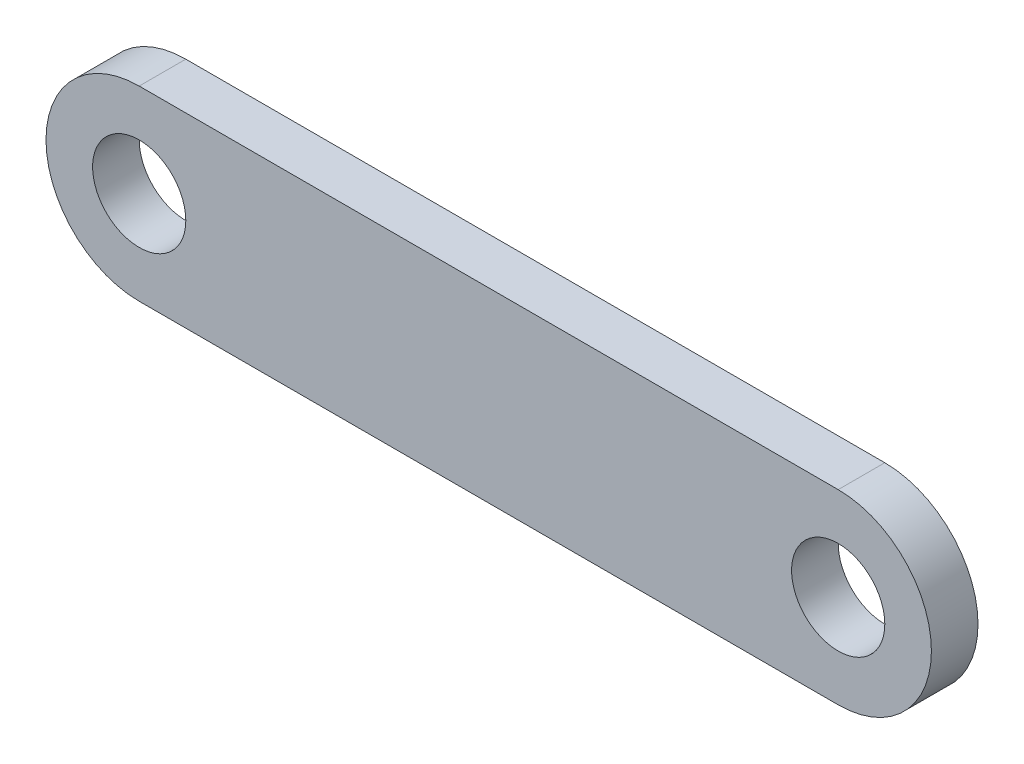
ISO-10303-21;
HEADER;
FILE_DESCRIPTION(('STEP AP214'),'2;1');
FILE_NAME('part.step','',(''),(''),'','','');
FILE_SCHEMA(('AUTOMOTIVE_DESIGN { 1 0 10303 214 1 1 1 1 }'));
ENDSEC;
DATA;
#1=APPLICATION_CONTEXT('core data for automotive mechanical design processes');
#2=APPLICATION_PROTOCOL_DEFINITION('international standard','automotive_design',2000,#1);
#3=PRODUCT_CONTEXT('',#1,'mechanical');
#4=PRODUCT('Part','Part','',(#3));
#5=PRODUCT_RELATED_PRODUCT_CATEGORY('part','',(#4));
#6=PRODUCT_DEFINITION_FORMATION('','',#4);
#7=PRODUCT_DEFINITION_CONTEXT('part definition',#1,'design');
#8=PRODUCT_DEFINITION('design','',#6,#7);
#9=PRODUCT_DEFINITION_SHAPE('','',#8);
#10=(LENGTH_UNIT() NAMED_UNIT(*) SI_UNIT(.MILLI.,.METRE.));
#11=(NAMED_UNIT(*) PLANE_ANGLE_UNIT() SI_UNIT($,.RADIAN.));
#12=(NAMED_UNIT(*) SI_UNIT($,.STERADIAN.) SOLID_ANGLE_UNIT());
#13=UNCERTAINTY_MEASURE_WITH_UNIT(LENGTH_MEASURE(1.E-05),#10,'distance_accuracy_value','');
#14=(GEOMETRIC_REPRESENTATION_CONTEXT(3) GLOBAL_UNCERTAINTY_ASSIGNED_CONTEXT((#13)) GLOBAL_UNIT_ASSIGNED_CONTEXT((#10,
#11,#12)) REPRESENTATION_CONTEXT('',''));
#15=CARTESIAN_POINT('',(0.,0.,0.));
#16=DIRECTION('',(0.,0.,1.));
#17=DIRECTION('',(1.,0.,0.));
#18=AXIS2_PLACEMENT_3D('',#15,#16,#17);
#19=CARTESIAN_POINT('',(0.,0.,2.54));
#20=DIRECTION('',(0.,0.,1.));
#21=DIRECTION('',(1.,0.,0.));
#22=AXIS2_PLACEMENT_3D('',#19,#20,#21);
#23=PLANE('',#22);
#24=CARTESIAN_POINT('',(0.,0.,2.54));
#25=DIRECTION('',(0.,0.,1.));
#26=DIRECTION('',(1.,0.,0.));
#27=AXIS2_PLACEMENT_3D('',#24,#25,#26);
#28=CIRCLE('',#27,2.54);
#29=CARTESIAN_POINT('',(2.54,0.,2.54));
#30=VERTEX_POINT('',#29);
#31=EDGE_CURVE('E101',#30,#30,#28,.T.);
#32=ORIENTED_EDGE('',*,*,#31,.F.);
#33=EDGE_LOOP('',(#32));
#34=FACE_BOUND('',#33,.T.);
#35=CARTESIAN_POINT('',(0.,0.,2.54));
#36=DIRECTION('',(0.,0.,1.));
#37=DIRECTION('',(1.,0.,0.));
#38=AXIS2_PLACEMENT_3D('',#35,#36,#37);
#39=CIRCLE('',#38,5.08);
#40=CARTESIAN_POINT('',(0.,5.08,2.54));
#41=VERTEX_POINT('',#40);
#42=CARTESIAN_POINT('',(0.,-5.08,2.54));
#43=VERTEX_POINT('',#42);
#44=EDGE_CURVE('E86',#41,#43,#39,.T.);
#45=ORIENTED_EDGE('',*,*,#44,.T.);
#46=DIRECTION('',(1.,0.,0.));
#47=VECTOR('',#46,1.);
#48=CARTESIAN_POINT('',(0.,-5.08,2.54));
#49=LINE('',#48,#47);
#50=CARTESIAN_POINT('',(38.1,-5.08,2.54));
#51=VERTEX_POINT('',#50);
#52=EDGE_CURVE('E81',#43,#51,#49,.T.);
#53=ORIENTED_EDGE('',*,*,#52,.T.);
#54=CARTESIAN_POINT('',(38.1,0.,2.54));
#55=DIRECTION('',(0.,0.,1.));
#56=DIRECTION('',(1.,0.,0.));
#57=AXIS2_PLACEMENT_3D('',#54,#55,#56);
#58=CIRCLE('',#57,5.08);
#59=CARTESIAN_POINT('',(38.1,5.08,2.54));
#60=VERTEX_POINT('',#59);
#61=EDGE_CURVE('E84',#51,#60,#58,.T.);
#62=ORIENTED_EDGE('',*,*,#61,.T.);
#63=DIRECTION('',(-1.,0.,0.));
#64=VECTOR('',#63,1.);
#65=CARTESIAN_POINT('',(0.,5.08,2.54));
#66=LINE('',#65,#64);
#67=EDGE_CURVE('E51',#60,#41,#66,.T.);
#68=ORIENTED_EDGE('',*,*,#67,.T.);
#69=EDGE_LOOP('',(#45,#53,#62,#68));
#70=FACE_BOUND('',#69,.T.);
#71=CARTESIAN_POINT('',(38.1,0.,2.54));
#72=DIRECTION('',(0.,0.,1.));
#73=DIRECTION('',(1.,0.,0.));
#74=AXIS2_PLACEMENT_3D('',#71,#72,#73);
#75=CIRCLE('',#74,2.54);
#76=CARTESIAN_POINT('',(40.64,0.,2.54));
#77=VERTEX_POINT('',#76);
#78=EDGE_CURVE('E116',#77,#77,#75,.T.);
#79=ORIENTED_EDGE('',*,*,#78,.F.);
#80=EDGE_LOOP('',(#79));
#81=FACE_BOUND('',#80,.T.);
#82=ADVANCED_FACE('F34',(#34,#70,#81),#23,.T.);
#83=CARTESIAN_POINT('',(0.,0.,0.));
#84=DIRECTION('',(0.,0.,1.));
#85=DIRECTION('',(1.,0.,0.));
#86=AXIS2_PLACEMENT_3D('',#83,#84,#85);
#87=PLANE('',#86);
#88=CARTESIAN_POINT('',(0.,0.,0.));
#89=DIRECTION('',(0.,0.,1.));
#90=DIRECTION('',(1.,0.,0.));
#91=AXIS2_PLACEMENT_3D('',#88,#89,#90);
#92=CIRCLE('',#91,5.08);
#93=CARTESIAN_POINT('',(0.,5.08,0.));
#94=VERTEX_POINT('',#93);
#95=CARTESIAN_POINT('',(0.,-5.08,0.));
#96=VERTEX_POINT('',#95);
#97=EDGE_CURVE('E98',#94,#96,#92,.T.);
#98=ORIENTED_EDGE('',*,*,#97,.F.);
#99=DIRECTION('',(-1.,0.,0.));
#100=VECTOR('',#99,1.);
#101=CARTESIAN_POINT('',(0.,5.08,0.));
#102=LINE('',#101,#100);
#103=CARTESIAN_POINT('',(38.1,5.08,0.));
#104=VERTEX_POINT('',#103);
#105=EDGE_CURVE('E74',#104,#94,#102,.T.);
#106=ORIENTED_EDGE('',*,*,#105,.F.);
#107=CARTESIAN_POINT('',(38.1,0.,0.));
#108=DIRECTION('',(0.,0.,1.));
#109=DIRECTION('',(1.,0.,0.));
#110=AXIS2_PLACEMENT_3D('',#107,#108,#109);
#111=CIRCLE('',#110,5.08);
#112=CARTESIAN_POINT('',(38.1,-5.08,0.));
#113=VERTEX_POINT('',#112);
#114=EDGE_CURVE('E68',#113,#104,#111,.T.);
#115=ORIENTED_EDGE('',*,*,#114,.F.);
#116=DIRECTION('',(1.,0.,0.));
#117=VECTOR('',#116,1.);
#118=CARTESIAN_POINT('',(0.,-5.08,0.));
#119=LINE('',#118,#117);
#120=EDGE_CURVE('E90',#96,#113,#119,.T.);
#121=ORIENTED_EDGE('',*,*,#120,.F.);
#122=EDGE_LOOP('',(#98,#106,#115,#121));
#123=FACE_BOUND('',#122,.T.);
#124=CARTESIAN_POINT('',(0.,0.,0.));
#125=DIRECTION('',(0.,0.,1.));
#126=DIRECTION('',(1.,0.,0.));
#127=AXIS2_PLACEMENT_3D('',#124,#125,#126);
#128=CIRCLE('',#127,2.54);
#129=CARTESIAN_POINT('',(2.54,0.,0.));
#130=VERTEX_POINT('',#129);
#131=EDGE_CURVE('E113',#130,#130,#128,.T.);
#132=ORIENTED_EDGE('',*,*,#131,.T.);
#133=EDGE_LOOP('',(#132));
#134=FACE_BOUND('',#133,.T.);
#135=CARTESIAN_POINT('',(38.1,0.,0.));
#136=DIRECTION('',(0.,0.,1.));
#137=DIRECTION('',(1.,0.,0.));
#138=AXIS2_PLACEMENT_3D('',#135,#136,#137);
#139=CIRCLE('',#138,2.54);
#140=CARTESIAN_POINT('',(40.64,0.,0.));
#141=VERTEX_POINT('',#140);
#142=EDGE_CURVE('E119',#141,#141,#139,.T.);
#143=ORIENTED_EDGE('',*,*,#142,.T.);
#144=EDGE_LOOP('',(#143));
#145=FACE_BOUND('',#144,.T.);
#146=ADVANCED_FACE('F109',(#123,#134,#145),#87,.F.);
#147=CARTESIAN_POINT('',(0.,0.,2.54));
#148=DIRECTION('',(0.,0.,-1.));
#149=DIRECTION('',(-1.,0.,0.));
#150=AXIS2_PLACEMENT_3D('',#147,#148,#149);
#151=CYLINDRICAL_SURFACE('',#150,5.08);
#152=ORIENTED_EDGE('',*,*,#97,.T.);
#153=DIRECTION('',(0.,0.,-1.));
#154=VECTOR('',#153,1.);
#155=CARTESIAN_POINT('',(0.,-5.08,2.54));
#156=LINE('',#155,#154);
#157=EDGE_CURVE('E11',#43,#96,#156,.T.);
#158=ORIENTED_EDGE('',*,*,#157,.F.);
#159=ORIENTED_EDGE('',*,*,#44,.F.);
#160=DIRECTION('',(0.,0.,-1.));
#161=VECTOR('',#160,1.);
#162=CARTESIAN_POINT('',(0.,5.08,2.54));
#163=LINE('',#162,#161);
#164=EDGE_CURVE('E94',#41,#94,#163,.T.);
#165=ORIENTED_EDGE('',*,*,#164,.T.);
#166=EDGE_LOOP('',(#152,#158,#159,#165));
#167=FACE_BOUND('',#166,.T.);
#168=ADVANCED_FACE('F36',(#167),#151,.T.);
#169=CARTESIAN_POINT('',(0.,-5.08,2.54));
#170=DIRECTION('',(0.,1.,0.));
#171=DIRECTION('',(0.,0.,1.));
#172=AXIS2_PLACEMENT_3D('',#169,#170,#171);
#173=PLANE('',#172);
#174=ORIENTED_EDGE('',*,*,#120,.T.);
#175=DIRECTION('',(0.,0.,-1.));
#176=VECTOR('',#175,1.);
#177=CARTESIAN_POINT('',(38.1,-5.08,2.54));
#178=LINE('',#177,#176);
#179=EDGE_CURVE('E43',#51,#113,#178,.T.);
#180=ORIENTED_EDGE('',*,*,#179,.F.);
#181=ORIENTED_EDGE('',*,*,#52,.F.);
#182=ORIENTED_EDGE('',*,*,#157,.T.);
#183=EDGE_LOOP('',(#174,#180,#181,#182));
#184=FACE_BOUND('',#183,.T.);
#185=ADVANCED_FACE('F89',(#184),#173,.F.);
#186=CARTESIAN_POINT('',(38.1,0.,2.54));
#187=DIRECTION('',(0.,0.,-1.));
#188=DIRECTION('',(-1.,0.,0.));
#189=AXIS2_PLACEMENT_3D('',#186,#187,#188);
#190=CYLINDRICAL_SURFACE('',#189,5.08);
#191=ORIENTED_EDGE('',*,*,#114,.T.);
#192=DIRECTION('',(0.,0.,-1.));
#193=VECTOR('',#192,1.);
#194=CARTESIAN_POINT('',(38.1,5.08,2.54));
#195=LINE('',#194,#193);
#196=EDGE_CURVE('E91',#60,#104,#195,.T.);
#197=ORIENTED_EDGE('',*,*,#196,.F.);
#198=ORIENTED_EDGE('',*,*,#61,.F.);
#199=ORIENTED_EDGE('',*,*,#179,.T.);
#200=EDGE_LOOP('',(#191,#197,#198,#199));
#201=FACE_BOUND('',#200,.T.);
#202=ADVANCED_FACE('F92',(#201),#190,.T.);
#203=CARTESIAN_POINT('',(0.,5.08,2.54));
#204=DIRECTION('',(0.,-1.,0.));
#205=DIRECTION('',(0.,0.,-1.));
#206=AXIS2_PLACEMENT_3D('',#203,#204,#205);
#207=PLANE('',#206);
#208=ORIENTED_EDGE('',*,*,#105,.T.);
#209=ORIENTED_EDGE('',*,*,#164,.F.);
#210=ORIENTED_EDGE('',*,*,#67,.F.);
#211=ORIENTED_EDGE('',*,*,#196,.T.);
#212=EDGE_LOOP('',(#208,#209,#210,#211));
#213=FACE_BOUND('',#212,.T.);
#214=ADVANCED_FACE('F106',(#213),#207,.F.);
#215=CARTESIAN_POINT('',(0.,0.,2.54));
#216=DIRECTION('',(0.,0.,-1.));
#217=DIRECTION('',(-1.,0.,0.));
#218=AXIS2_PLACEMENT_3D('',#215,#216,#217);
#219=CYLINDRICAL_SURFACE('',#218,2.54);
#220=ORIENTED_EDGE('',*,*,#31,.T.);
#221=EDGE_LOOP('',(#220));
#222=FACE_BOUND('',#221,.T.);
#223=ORIENTED_EDGE('',*,*,#131,.F.);
#224=EDGE_LOOP('',(#223));
#225=FACE_BOUND('',#224,.T.);
#226=ADVANCED_FACE('F136',(#222,#225),#219,.F.);
#227=CARTESIAN_POINT('',(38.1,0.,2.54));
#228=DIRECTION('',(0.,0.,-1.));
#229=DIRECTION('',(-1.,0.,0.));
#230=AXIS2_PLACEMENT_3D('',#227,#228,#229);
#231=CYLINDRICAL_SURFACE('',#230,2.54);
#232=ORIENTED_EDGE('',*,*,#78,.T.);
#233=EDGE_LOOP('',(#232));
#234=FACE_BOUND('',#233,.T.);
#235=ORIENTED_EDGE('',*,*,#142,.F.);
#236=EDGE_LOOP('',(#235));
#237=FACE_BOUND('',#236,.T.);
#238=ADVANCED_FACE('F125',(#234,#237),#231,.F.);
#239=CLOSED_SHELL('',(#82,#146,#168,#185,#202,#214,#226,#238));
#240=MANIFOLD_SOLID_BREP('B2',#239);
#241=ADVANCED_BREP_SHAPE_REPRESENTATION('',(#18,#240),#14);
#242=SHAPE_DEFINITION_REPRESENTATION(#9,#241);
ENDSEC;
END-ISO-10303-21;
